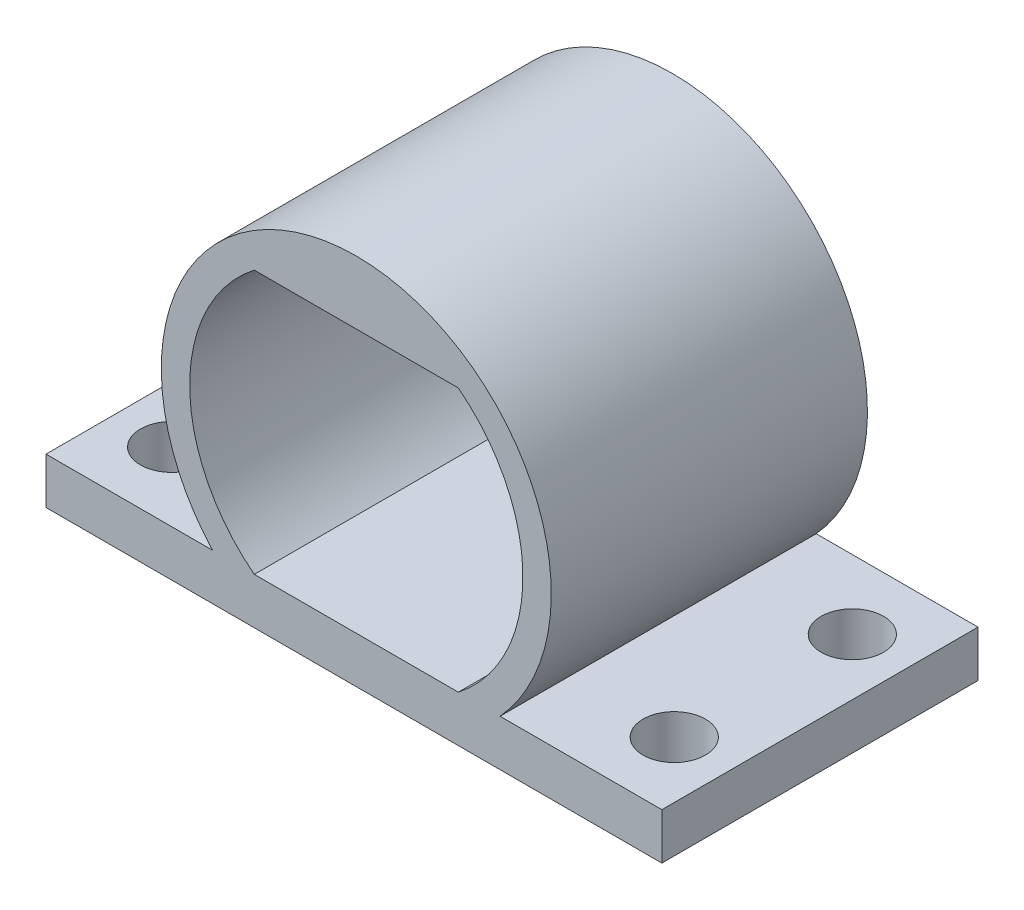
ISO-10303-21;
HEADER;
FILE_DESCRIPTION(('STEP AP214'),'2;1');
FILE_NAME('part.step','',(''),(''),'','','');
FILE_SCHEMA(('AUTOMOTIVE_DESIGN { 1 0 10303 214 1 1 1 1 }'));
ENDSEC;
DATA;
#1=APPLICATION_CONTEXT('core data for automotive mechanical design processes');
#2=APPLICATION_PROTOCOL_DEFINITION('international standard','automotive_design',2000,#1);
#3=PRODUCT_CONTEXT('',#1,'mechanical');
#4=PRODUCT('Part','Part','',(#3));
#5=PRODUCT_RELATED_PRODUCT_CATEGORY('part','',(#4));
#6=PRODUCT_DEFINITION_FORMATION('','',#4);
#7=PRODUCT_DEFINITION_CONTEXT('part definition',#1,'design');
#8=PRODUCT_DEFINITION('design','',#6,#7);
#9=PRODUCT_DEFINITION_SHAPE('','',#8);
#10=(LENGTH_UNIT() NAMED_UNIT(*) SI_UNIT(.MILLI.,.METRE.));
#11=(NAMED_UNIT(*) PLANE_ANGLE_UNIT() SI_UNIT($,.RADIAN.));
#12=(NAMED_UNIT(*) SI_UNIT($,.STERADIAN.) SOLID_ANGLE_UNIT());
#13=UNCERTAINTY_MEASURE_WITH_UNIT(LENGTH_MEASURE(1.E-05),#10,'distance_accuracy_value','');
#14=(GEOMETRIC_REPRESENTATION_CONTEXT(3) GLOBAL_UNCERTAINTY_ASSIGNED_CONTEXT((#13)) GLOBAL_UNIT_ASSIGNED_CONTEXT((#10,
#11,#12)) REPRESENTATION_CONTEXT('',''));
#15=CARTESIAN_POINT('',(0.,0.,0.));
#16=DIRECTION('',(0.,0.,1.));
#17=DIRECTION('',(1.,0.,0.));
#18=AXIS2_PLACEMENT_3D('',#15,#16,#17);
#19=CARTESIAN_POINT('',(11.5970734347748,0.,12.));
#20=DIRECTION('',(-1.,0.,0.));
#21=DIRECTION('',(0.,-1.,0.));
#22=AXIS2_PLACEMENT_3D('',#19,#20,#21);
#23=PLANE('',#22);
#24=DIRECTION('',(0.,1.,0.));
#25=VECTOR('',#24,1.);
#26=CARTESIAN_POINT('',(11.5970734347748,0.,0.));
#27=LINE('',#26,#25);
#28=CARTESIAN_POINT('',(11.5970734347748,-6.75648066721211,0.));
#29=VERTEX_POINT('',#28);
#30=CARTESIAN_POINT('',(11.5970734347748,-4.99999999999995,0.));
#31=VERTEX_POINT('',#30);
#32=EDGE_CURVE('E64',#29,#31,#27,.T.);
#33=ORIENTED_EDGE('',*,*,#32,.T.);
#34=DIRECTION('',(0.,0.,-1.));
#35=VECTOR('',#34,1.);
#36=CARTESIAN_POINT('',(11.5970734347748,-4.99999999999995,12.));
#37=LINE('',#36,#35);
#38=CARTESIAN_POINT('',(11.5970734347748,-4.99999999999995,12.));
#39=VERTEX_POINT('',#38);
#40=EDGE_CURVE('E128',#39,#31,#37,.T.);
#41=ORIENTED_EDGE('',*,*,#40,.F.);
#42=DIRECTION('',(0.,1.,0.));
#43=VECTOR('',#42,1.);
#44=CARTESIAN_POINT('',(11.5970734347748,0.,12.));
#45=LINE('',#44,#43);
#46=CARTESIAN_POINT('',(11.5970734347748,-6.75648066721211,12.));
#47=VERTEX_POINT('',#46);
#48=EDGE_CURVE('E106',#47,#39,#45,.T.);
#49=ORIENTED_EDGE('',*,*,#48,.F.);
#50=DIRECTION('',(0.,0.,1.));
#51=VECTOR('',#50,1.);
#52=CARTESIAN_POINT('',(11.5970734347748,-6.75648066721211,0.));
#53=LINE('',#52,#51);
#54=EDGE_CURVE('E187',#29,#47,#53,.T.);
#55=ORIENTED_EDGE('',*,*,#54,.F.);
#56=EDGE_LOOP('',(#33,#41,#49,#55));
#57=FACE_BOUND('',#56,.T.);
#58=ADVANCED_FACE('F35',(#57),#23,.F.);
#59=CARTESIAN_POINT('',(0.,-5.00000000000001,12.));
#60=DIRECTION('',(0.,-1.,0.));
#61=DIRECTION('',(1.,0.,0.));
#62=AXIS2_PLACEMENT_3D('',#59,#60,#61);
#63=PLANE('',#62);
#64=CARTESIAN_POINT('',(9.44716308171162,-4.99999999999998,2.6202118339138));
#65=DIRECTION('',(0.,1.,0.));
#66=DIRECTION('',(-1.,0.,0.));
#67=AXIS2_PLACEMENT_3D('',#64,#65,#66);
#68=CIRCLE('',#67,1.18469827668088);
#69=CARTESIAN_POINT('',(8.26246480503075,-4.99999999999999,2.6202118339138));
#70=VERTEX_POINT('',#69);
#71=EDGE_CURVE('E198',#70,#70,#68,.T.);
#72=ORIENTED_EDGE('',*,*,#71,.F.);
#73=EDGE_LOOP('',(#72));
#74=FACE_BOUND('',#73,.T.);
#75=CARTESIAN_POINT('',(9.44716308171162,-4.99999999999998,9.3797881660862));
#76=DIRECTION('',(0.,1.,0.));
#77=DIRECTION('',(1.,0.,0.));
#78=AXIS2_PLACEMENT_3D('',#75,#76,#77);
#79=CIRCLE('',#78,1.18469827668088);
#80=CARTESIAN_POINT('',(10.6318613583925,-4.99999999999998,9.3797881660862));
#81=VERTEX_POINT('',#80);
#82=EDGE_CURVE('E201',#81,#81,#79,.T.);
#83=ORIENTED_EDGE('',*,*,#82,.F.);
#84=EDGE_LOOP('',(#83));
#85=FACE_BOUND('',#84,.T.);
#86=DIRECTION('',(-1.,0.,0.));
#87=VECTOR('',#86,1.);
#88=CARTESIAN_POINT('',(0.,-5.00000000000001,0.));
#89=LINE('',#88,#87);
#90=CARTESIAN_POINT('',(5.45614590766997,-4.99999999999998,0.));
#91=VERTEX_POINT('',#90);
#92=EDGE_CURVE('E118',#31,#91,#89,.T.);
#93=ORIENTED_EDGE('',*,*,#92,.T.);
#94=DIRECTION('',(0.,0.,1.));
#95=VECTOR('',#94,1.);
#96=CARTESIAN_POINT('',(5.45614590766997,-4.99999999999998,0.));
#97=LINE('',#96,#95);
#98=CARTESIAN_POINT('',(5.45614590766997,-4.99999999999998,12.));
#99=VERTEX_POINT('',#98);
#100=EDGE_CURVE('E89',#91,#99,#97,.T.);
#101=ORIENTED_EDGE('',*,*,#100,.T.);
#102=DIRECTION('',(-1.,0.,0.));
#103=VECTOR('',#102,1.);
#104=CARTESIAN_POINT('',(0.,-5.00000000000001,12.));
#105=LINE('',#104,#103);
#106=EDGE_CURVE('E98',#39,#99,#105,.T.);
#107=ORIENTED_EDGE('',*,*,#106,.F.);
#108=ORIENTED_EDGE('',*,*,#40,.T.);
#109=EDGE_LOOP('',(#93,#101,#107,#108));
#110=FACE_BOUND('',#109,.T.);
#111=ADVANCED_FACE('F213',(#74,#85,#110),#63,.F.);
#112=CARTESIAN_POINT('',(0.,-5.,12.));
#113=DIRECTION('',(0.,1.,0.));
#114=DIRECTION('',(-1.,0.,0.));
#115=AXIS2_PLACEMENT_3D('',#112,#113,#114);
#116=PLANE('',#115);
#117=DIRECTION('',(0.,0.,1.));
#118=VECTOR('',#117,1.);
#119=CARTESIAN_POINT('',(-5.45614590766993,-5.00000000000002,0.));
#120=LINE('',#119,#118);
#121=CARTESIAN_POINT('',(-5.45614590766993,-5.00000000000002,0.));
#122=VERTEX_POINT('',#121);
#123=CARTESIAN_POINT('',(-5.45614590766993,-5.00000000000002,12.));
#124=VERTEX_POINT('',#123);
#125=EDGE_CURVE('E82',#122,#124,#120,.T.);
#126=ORIENTED_EDGE('',*,*,#125,.F.);
#127=DIRECTION('',(1.,0.,0.));
#128=VECTOR('',#127,1.);
#129=CARTESIAN_POINT('',(0.,-5.,0.));
#130=LINE('',#129,#128);
#131=CARTESIAN_POINT('',(-11.7770736373848,-5.00000000000003,0.));
#132=VERTEX_POINT('',#131);
#133=EDGE_CURVE('E121',#132,#122,#130,.T.);
#134=ORIENTED_EDGE('',*,*,#133,.F.);
#135=DIRECTION('',(0.,0.,-1.));
#136=VECTOR('',#135,1.);
#137=CARTESIAN_POINT('',(-11.7770736373848,-5.00000000000003,12.));
#138=LINE('',#137,#136);
#139=CARTESIAN_POINT('',(-11.7770736373848,-5.00000000000003,12.));
#140=VERTEX_POINT('',#139);
#141=EDGE_CURVE('E52',#140,#132,#138,.T.);
#142=ORIENTED_EDGE('',*,*,#141,.F.);
#143=DIRECTION('',(1.,0.,0.));
#144=VECTOR('',#143,1.);
#145=CARTESIAN_POINT('',(0.,-5.,12.));
#146=LINE('',#145,#144);
#147=EDGE_CURVE('E95',#140,#124,#146,.T.);
#148=ORIENTED_EDGE('',*,*,#147,.T.);
#149=EDGE_LOOP('',(#126,#134,#142,#148));
#150=FACE_BOUND('',#149,.T.);
#151=CARTESIAN_POINT('',(-9.62716328432161,-5.00000000000003,2.6202118339138));
#152=DIRECTION('',(0.,1.,0.));
#153=DIRECTION('',(1.,0.,0.));
#154=AXIS2_PLACEMENT_3D('',#151,#152,#153);
#155=CIRCLE('',#154,1.18469827668088);
#156=CARTESIAN_POINT('',(-8.44246500764073,-5.00000000000002,2.6202118339138));
#157=VERTEX_POINT('',#156);
#158=EDGE_CURVE('E88',#157,#157,#155,.T.);
#159=ORIENTED_EDGE('',*,*,#158,.F.);
#160=EDGE_LOOP('',(#159));
#161=FACE_BOUND('',#160,.T.);
#162=CARTESIAN_POINT('',(-9.62716328432161,-5.00000000000003,9.3797881660862));
#163=DIRECTION('',(0.,1.,0.));
#164=DIRECTION('',(-1.,0.,0.));
#165=AXIS2_PLACEMENT_3D('',#162,#163,#164);
#166=CIRCLE('',#165,1.18469827668088);
#167=CARTESIAN_POINT('',(-10.8118615610025,-5.00000000000003,9.3797881660862));
#168=VERTEX_POINT('',#167);
#169=EDGE_CURVE('E114',#168,#168,#166,.T.);
#170=ORIENTED_EDGE('',*,*,#169,.F.);
#171=EDGE_LOOP('',(#170));
#172=FACE_BOUND('',#171,.T.);
#173=ADVANCED_FACE('F101',(#150,#161,#172),#116,.T.);
#174=CARTESIAN_POINT('',(0.,-5.,12.));
#175=DIRECTION('',(0.,1.,0.));
#176=DIRECTION('',(-1.,0.,0.));
#177=AXIS2_PLACEMENT_3D('',#174,#175,#176);
#178=PLANE('',#177);
#179=DIRECTION('',(1.,0.,0.));
#180=VECTOR('',#179,1.);
#181=CARTESIAN_POINT('',(0.,-5.,0.));
#182=LINE('',#181,#180);
#183=CARTESIAN_POINT('',(-3.87177420326201,-5.00000000000001,0.));
#184=VERTEX_POINT('',#183);
#185=CARTESIAN_POINT('',(3.87177420326201,-5.00000000000001,0.));
#186=VERTEX_POINT('',#185);
#187=EDGE_CURVE('E110',#184,#186,#182,.T.);
#188=ORIENTED_EDGE('',*,*,#187,.F.);
#189=DIRECTION('',(0.,0.,1.));
#190=VECTOR('',#189,1.);
#191=CARTESIAN_POINT('',(-3.87177420326201,-5.00000000000001,-7.));
#192=LINE('',#191,#190);
#193=CARTESIAN_POINT('',(-3.87177420326201,-5.00000000000001,12.));
#194=VERTEX_POINT('',#193);
#195=EDGE_CURVE('E165',#184,#194,#192,.T.);
#196=ORIENTED_EDGE('',*,*,#195,.T.);
#197=DIRECTION('',(1.,0.,0.));
#198=VECTOR('',#197,1.);
#199=CARTESIAN_POINT('',(0.,-5.,12.));
#200=LINE('',#199,#198);
#201=CARTESIAN_POINT('',(3.87177420326201,-5.00000000000001,12.));
#202=VERTEX_POINT('',#201);
#203=EDGE_CURVE('E126',#194,#202,#200,.T.);
#204=ORIENTED_EDGE('',*,*,#203,.T.);
#205=DIRECTION('',(0.,0.,1.));
#206=VECTOR('',#205,1.);
#207=CARTESIAN_POINT('',(3.87177420326201,-5.00000000000001,-7.));
#208=LINE('',#207,#206);
#209=EDGE_CURVE('E177',#186,#202,#208,.T.);
#210=ORIENTED_EDGE('',*,*,#209,.F.);
#211=EDGE_LOOP('',(#188,#196,#204,#210));
#212=FACE_BOUND('',#211,.T.);
#213=ADVANCED_FACE('F37',(#212),#178,.T.);
#214=CARTESIAN_POINT('',(0.,5.,12.));
#215=DIRECTION('',(0.,1.,0.));
#216=DIRECTION('',(-1.,0.,0.));
#217=AXIS2_PLACEMENT_3D('',#214,#215,#216);
#218=PLANE('',#217);
#219=DIRECTION('',(1.,0.,0.));
#220=VECTOR('',#219,1.);
#221=CARTESIAN_POINT('',(0.,5.,0.));
#222=LINE('',#221,#220);
#223=CARTESIAN_POINT('',(-3.87177420326204,4.99999999999999,0.));
#224=VERTEX_POINT('',#223);
#225=CARTESIAN_POINT('',(3.87177420326204,4.99999999999999,0.));
#226=VERTEX_POINT('',#225);
#227=EDGE_CURVE('E113',#224,#226,#222,.T.);
#228=ORIENTED_EDGE('',*,*,#227,.T.);
#229=DIRECTION('',(0.,0.,1.));
#230=VECTOR('',#229,1.);
#231=CARTESIAN_POINT('',(3.87177420326204,4.99999999999999,-7.));
#232=LINE('',#231,#230);
#233=CARTESIAN_POINT('',(3.87177420326204,4.99999999999999,12.));
#234=VERTEX_POINT('',#233);
#235=EDGE_CURVE('E142',#226,#234,#232,.T.);
#236=ORIENTED_EDGE('',*,*,#235,.T.);
#237=DIRECTION('',(1.,0.,0.));
#238=VECTOR('',#237,1.);
#239=CARTESIAN_POINT('',(0.,5.,12.));
#240=LINE('',#239,#238);
#241=CARTESIAN_POINT('',(-3.87177420326204,4.99999999999999,12.));
#242=VERTEX_POINT('',#241);
#243=EDGE_CURVE('E174',#242,#234,#240,.T.);
#244=ORIENTED_EDGE('',*,*,#243,.F.);
#245=DIRECTION('',(0.,0.,1.));
#246=VECTOR('',#245,1.);
#247=CARTESIAN_POINT('',(-3.87177420326204,4.99999999999999,-7.));
#248=LINE('',#247,#246);
#249=EDGE_CURVE('E162',#224,#242,#248,.T.);
#250=ORIENTED_EDGE('',*,*,#249,.F.);
#251=EDGE_LOOP('',(#228,#236,#244,#250));
#252=FACE_BOUND('',#251,.T.);
#253=ADVANCED_FACE('F170',(#252),#218,.F.);
#254=CARTESIAN_POINT('',(-11.7770736373848,0.,12.));
#255=DIRECTION('',(-1.,0.,0.));
#256=DIRECTION('',(0.,0.,1.));
#257=AXIS2_PLACEMENT_3D('',#254,#255,#256);
#258=PLANE('',#257);
#259=DIRECTION('',(0.,1.,0.));
#260=VECTOR('',#259,1.);
#261=CARTESIAN_POINT('',(-11.7770736373848,0.,0.));
#262=LINE('',#261,#260);
#263=CARTESIAN_POINT('',(-11.7770736373848,-6.75648066721211,0.));
#264=VERTEX_POINT('',#263);
#265=EDGE_CURVE('E123',#264,#132,#262,.T.);
#266=ORIENTED_EDGE('',*,*,#265,.F.);
#267=DIRECTION('',(0.,0.,1.));
#268=VECTOR('',#267,1.);
#269=CARTESIAN_POINT('',(-11.7770736373848,-6.75648066721211,0.));
#270=LINE('',#269,#268);
#271=CARTESIAN_POINT('',(-11.7770736373848,-6.75648066721211,12.));
#272=VERTEX_POINT('',#271);
#273=EDGE_CURVE('E99',#264,#272,#270,.T.);
#274=ORIENTED_EDGE('',*,*,#273,.T.);
#275=DIRECTION('',(0.,1.,0.));
#276=VECTOR('',#275,1.);
#277=CARTESIAN_POINT('',(-11.7770736373848,0.,12.));
#278=LINE('',#277,#276);
#279=EDGE_CURVE('E103',#272,#140,#278,.T.);
#280=ORIENTED_EDGE('',*,*,#279,.T.);
#281=ORIENTED_EDGE('',*,*,#141,.T.);
#282=EDGE_LOOP('',(#266,#274,#280,#281));
#283=FACE_BOUND('',#282,.T.);
#284=ADVANCED_FACE('F218',(#283),#258,.T.);
#285=CARTESIAN_POINT('',(0.,0.,12.));
#286=DIRECTION('',(0.,0.,1.));
#287=DIRECTION('',(1.,0.,0.));
#288=AXIS2_PLACEMENT_3D('',#285,#286,#287);
#289=PLANE('',#288);
#290=CARTESIAN_POINT('',(0.,0.,12.));
#291=DIRECTION('',(0.,0.,1.));
#292=DIRECTION('',(1.,0.,0.));
#293=AXIS2_PLACEMENT_3D('',#290,#291,#292);
#294=CIRCLE('',#293,6.32381494677424);
#295=EDGE_CURVE('E175',#202,#234,#294,.T.);
#296=ORIENTED_EDGE('',*,*,#295,.F.);
#297=ORIENTED_EDGE('',*,*,#203,.F.);
#298=CARTESIAN_POINT('',(0.,0.,12.));
#299=DIRECTION('',(0.,0.,1.));
#300=DIRECTION('',(1.,0.,0.));
#301=AXIS2_PLACEMENT_3D('',#298,#299,#300);
#302=CIRCLE('',#301,6.32381494677424);
#303=EDGE_CURVE('E180',#242,#194,#302,.T.);
#304=ORIENTED_EDGE('',*,*,#303,.F.);
#305=ORIENTED_EDGE('',*,*,#243,.T.);
#306=EDGE_LOOP('',(#296,#297,#304,#305));
#307=FACE_BOUND('',#306,.T.);
#308=ORIENTED_EDGE('',*,*,#279,.F.);
#309=DIRECTION('',(1.,0.,0.));
#310=VECTOR('',#309,1.);
#311=CARTESIAN_POINT('',(0.,-6.75648066721211,12.));
#312=LINE('',#311,#310);
#313=EDGE_CURVE('E133',#272,#47,#312,.T.);
#314=ORIENTED_EDGE('',*,*,#313,.T.);
#315=ORIENTED_EDGE('',*,*,#48,.T.);
#316=ORIENTED_EDGE('',*,*,#106,.T.);
#317=CARTESIAN_POINT('',(0.,0.,12.));
#318=DIRECTION('',(0.,0.,1.));
#319=DIRECTION('',(1.,0.,0.));
#320=AXIS2_PLACEMENT_3D('',#317,#318,#319);
#321=CIRCLE('',#320,7.40064376698295);
#322=EDGE_CURVE('E85',#99,#124,#321,.T.);
#323=ORIENTED_EDGE('',*,*,#322,.T.);
#324=ORIENTED_EDGE('',*,*,#147,.F.);
#325=EDGE_LOOP('',(#308,#314,#315,#316,#323,#324));
#326=FACE_BOUND('',#325,.T.);
#327=ADVANCED_FACE('F94',(#307,#326),#289,.T.);
#328=CARTESIAN_POINT('',(0.,0.,0.));
#329=DIRECTION('',(0.,0.,1.));
#330=DIRECTION('',(1.,0.,0.));
#331=AXIS2_PLACEMENT_3D('',#328,#329,#330);
#332=PLANE('',#331);
#333=ORIENTED_EDGE('',*,*,#187,.T.);
#334=CARTESIAN_POINT('',(0.,0.,0.));
#335=DIRECTION('',(0.,0.,1.));
#336=DIRECTION('',(1.,0.,0.));
#337=AXIS2_PLACEMENT_3D('',#334,#335,#336);
#338=CIRCLE('',#337,6.32381494677424);
#339=EDGE_CURVE('E11',#186,#226,#338,.T.);
#340=ORIENTED_EDGE('',*,*,#339,.T.);
#341=ORIENTED_EDGE('',*,*,#227,.F.);
#342=CARTESIAN_POINT('',(0.,0.,0.));
#343=DIRECTION('',(0.,0.,1.));
#344=DIRECTION('',(1.,0.,0.));
#345=AXIS2_PLACEMENT_3D('',#342,#343,#344);
#346=CIRCLE('',#345,6.32381494677424);
#347=EDGE_CURVE('E44',#224,#184,#346,.T.);
#348=ORIENTED_EDGE('',*,*,#347,.T.);
#349=EDGE_LOOP('',(#333,#340,#341,#348));
#350=FACE_BOUND('',#349,.T.);
#351=ORIENTED_EDGE('',*,*,#32,.F.);
#352=DIRECTION('',(1.,0.,0.));
#353=VECTOR('',#352,1.);
#354=CARTESIAN_POINT('',(0.,-6.75648066721211,0.));
#355=LINE('',#354,#353);
#356=EDGE_CURVE('E184',#264,#29,#355,.T.);
#357=ORIENTED_EDGE('',*,*,#356,.F.);
#358=ORIENTED_EDGE('',*,*,#265,.T.);
#359=ORIENTED_EDGE('',*,*,#133,.T.);
#360=CARTESIAN_POINT('',(0.,0.,0.));
#361=DIRECTION('',(0.,0.,1.));
#362=DIRECTION('',(1.,0.,0.));
#363=AXIS2_PLACEMENT_3D('',#360,#361,#362);
#364=CIRCLE('',#363,7.40064376698295);
#365=EDGE_CURVE('E73',#91,#122,#364,.T.);
#366=ORIENTED_EDGE('',*,*,#365,.F.);
#367=ORIENTED_EDGE('',*,*,#92,.F.);
#368=EDGE_LOOP('',(#351,#357,#358,#359,#366,#367));
#369=FACE_BOUND('',#368,.T.);
#370=ADVANCED_FACE('F148',(#350,#369),#332,.F.);
#371=CARTESIAN_POINT('',(-9.6271632843216,-10.,9.3797881660862));
#372=DIRECTION('',(0.,1.,0.));
#373=DIRECTION('',(-1.,0.,0.));
#374=AXIS2_PLACEMENT_3D('',#371,#372,#373);
#375=CYLINDRICAL_SURFACE('',#374,1.18469827668088);
#376=ORIENTED_EDGE('',*,*,#169,.T.);
#377=EDGE_LOOP('',(#376));
#378=FACE_BOUND('',#377,.T.);
#379=CARTESIAN_POINT('',(-9.62716328432161,-6.75648066721211,9.3797881660862));
#380=DIRECTION('',(0.,-1.,0.));
#381=DIRECTION('',(0.,0.,-1.));
#382=AXIS2_PLACEMENT_3D('',#379,#380,#381);
#383=CIRCLE('',#382,1.18469827668088);
#384=CARTESIAN_POINT('',(-9.62716328432161,-6.75648066721211,8.19508988940532));
#385=VERTEX_POINT('',#384);
#386=EDGE_CURVE('E134',#385,#385,#383,.T.);
#387=ORIENTED_EDGE('',*,*,#386,.T.);
#388=EDGE_LOOP('',(#387));
#389=FACE_BOUND('',#388,.T.);
#390=ADVANCED_FACE('F273',(#378,#389),#375,.F.);
#391=CARTESIAN_POINT('',(9.44716308171164,-9.99999999999998,9.3797881660862));
#392=DIRECTION('',(0.,1.,0.));
#393=DIRECTION('',(-1.,0.,0.));
#394=AXIS2_PLACEMENT_3D('',#391,#392,#393);
#395=CYLINDRICAL_SURFACE('',#394,1.18469827668088);
#396=ORIENTED_EDGE('',*,*,#82,.T.);
#397=EDGE_LOOP('',(#396));
#398=FACE_BOUND('',#397,.T.);
#399=CARTESIAN_POINT('',(9.44716308171163,-6.75648066721211,9.3797881660862));
#400=DIRECTION('',(0.,-1.,0.));
#401=DIRECTION('',(0.,0.,-1.));
#402=AXIS2_PLACEMENT_3D('',#399,#400,#401);
#403=CIRCLE('',#402,1.18469827668088);
#404=CARTESIAN_POINT('',(9.44716308171163,-6.75648066721211,8.19508988940532));
#405=VERTEX_POINT('',#404);
#406=EDGE_CURVE('E140',#405,#405,#403,.T.);
#407=ORIENTED_EDGE('',*,*,#406,.T.);
#408=EDGE_LOOP('',(#407));
#409=FACE_BOUND('',#408,.T.);
#410=ADVANCED_FACE('F278',(#398,#409),#395,.F.);
#411=CARTESIAN_POINT('',(9.44716308171164,-9.99999999999998,2.6202118339138));
#412=DIRECTION('',(0.,1.,0.));
#413=DIRECTION('',(-1.,0.,0.));
#414=AXIS2_PLACEMENT_3D('',#411,#412,#413);
#415=CYLINDRICAL_SURFACE('',#414,1.18469827668088);
#416=ORIENTED_EDGE('',*,*,#71,.T.);
#417=EDGE_LOOP('',(#416));
#418=FACE_BOUND('',#417,.T.);
#419=CARTESIAN_POINT('',(9.44716308171163,-6.75648066721211,2.6202118339138));
#420=DIRECTION('',(0.,-1.,0.));
#421=DIRECTION('',(0.,0.,-1.));
#422=AXIS2_PLACEMENT_3D('',#419,#420,#421);
#423=CIRCLE('',#422,1.18469827668088);
#424=CARTESIAN_POINT('',(9.44716308171163,-6.75648066721211,1.43551355723292));
#425=VERTEX_POINT('',#424);
#426=EDGE_CURVE('E137',#425,#425,#423,.T.);
#427=ORIENTED_EDGE('',*,*,#426,.T.);
#428=EDGE_LOOP('',(#427));
#429=FACE_BOUND('',#428,.T.);
#430=ADVANCED_FACE('F282',(#418,#429),#415,.F.);
#431=CARTESIAN_POINT('',(-9.6271632843216,-10.,2.6202118339138));
#432=DIRECTION('',(0.,1.,0.));
#433=DIRECTION('',(-1.,0.,0.));
#434=AXIS2_PLACEMENT_3D('',#431,#432,#433);
#435=CYLINDRICAL_SURFACE('',#434,1.18469827668088);
#436=ORIENTED_EDGE('',*,*,#158,.T.);
#437=EDGE_LOOP('',(#436));
#438=FACE_BOUND('',#437,.T.);
#439=CARTESIAN_POINT('',(-9.62716328432161,-6.75648066721211,2.6202118339138));
#440=DIRECTION('',(0.,-1.,0.));
#441=DIRECTION('',(0.,0.,-1.));
#442=AXIS2_PLACEMENT_3D('',#439,#440,#441);
#443=CIRCLE('',#442,1.18469827668088);
#444=CARTESIAN_POINT('',(-9.62716328432161,-6.75648066721211,1.43551355723292));
#445=VERTEX_POINT('',#444);
#446=EDGE_CURVE('E130',#445,#445,#443,.T.);
#447=ORIENTED_EDGE('',*,*,#446,.T.);
#448=EDGE_LOOP('',(#447));
#449=FACE_BOUND('',#448,.T.);
#450=ADVANCED_FACE('F286',(#438,#449),#435,.F.);
#451=CARTESIAN_POINT('',(0.,0.,0.));
#452=DIRECTION('',(0.,0.,1.));
#453=DIRECTION('',(1.,0.,0.));
#454=AXIS2_PLACEMENT_3D('',#451,#452,#453);
#455=CYLINDRICAL_SURFACE('',#454,7.40064376698295);
#456=ORIENTED_EDGE('',*,*,#322,.F.);
#457=ORIENTED_EDGE('',*,*,#100,.F.);
#458=ORIENTED_EDGE('',*,*,#365,.T.);
#459=ORIENTED_EDGE('',*,*,#125,.T.);
#460=EDGE_LOOP('',(#456,#457,#458,#459));
#461=FACE_BOUND('',#460,.T.);
#462=ADVANCED_FACE('F84',(#461),#455,.T.);
#463=CARTESIAN_POINT('',(0.,-6.75648066721211,0.));
#464=DIRECTION('',(0.,-1.,0.));
#465=DIRECTION('',(0.,0.,-1.));
#466=AXIS2_PLACEMENT_3D('',#463,#464,#465);
#467=PLANE('',#466);
#468=ORIENTED_EDGE('',*,*,#406,.F.);
#469=EDGE_LOOP('',(#468));
#470=FACE_BOUND('',#469,.T.);
#471=ORIENTED_EDGE('',*,*,#426,.F.);
#472=EDGE_LOOP('',(#471));
#473=FACE_BOUND('',#472,.T.);
#474=ORIENTED_EDGE('',*,*,#386,.F.);
#475=EDGE_LOOP('',(#474));
#476=FACE_BOUND('',#475,.T.);
#477=ORIENTED_EDGE('',*,*,#446,.F.);
#478=EDGE_LOOP('',(#477));
#479=FACE_BOUND('',#478,.T.);
#480=ORIENTED_EDGE('',*,*,#313,.F.);
#481=ORIENTED_EDGE('',*,*,#273,.F.);
#482=ORIENTED_EDGE('',*,*,#356,.T.);
#483=ORIENTED_EDGE('',*,*,#54,.T.);
#484=EDGE_LOOP('',(#480,#481,#482,#483));
#485=FACE_BOUND('',#484,.T.);
#486=ADVANCED_FACE('F223',(#470,#473,#476,#479,#485),#467,.T.);
#487=CARTESIAN_POINT('',(0.,0.,-7.));
#488=DIRECTION('',(0.,0.,1.));
#489=DIRECTION('',(1.,0.,0.));
#490=AXIS2_PLACEMENT_3D('',#487,#488,#489);
#491=CYLINDRICAL_SURFACE('',#490,6.32381494677424);
#492=ORIENTED_EDGE('',*,*,#249,.T.);
#493=ORIENTED_EDGE('',*,*,#303,.T.);
#494=ORIENTED_EDGE('',*,*,#195,.F.);
#495=ORIENTED_EDGE('',*,*,#347,.F.);
#496=EDGE_LOOP('',(#492,#493,#494,#495));
#497=FACE_BOUND('',#496,.T.);
#498=ADVANCED_FACE('F159',(#497),#491,.F.);
#499=CARTESIAN_POINT('',(0.,0.,-7.));
#500=DIRECTION('',(0.,0.,1.));
#501=DIRECTION('',(1.,0.,0.));
#502=AXIS2_PLACEMENT_3D('',#499,#500,#501);
#503=CYLINDRICAL_SURFACE('',#502,6.32381494677424);
#504=ORIENTED_EDGE('',*,*,#209,.T.);
#505=ORIENTED_EDGE('',*,*,#295,.T.);
#506=ORIENTED_EDGE('',*,*,#235,.F.);
#507=ORIENTED_EDGE('',*,*,#339,.F.);
#508=EDGE_LOOP('',(#504,#505,#506,#507));
#509=FACE_BOUND('',#508,.T.);
#510=ADVANCED_FACE('F244',(#509),#503,.F.);
#511=CLOSED_SHELL('',(#58,#111,#173,#213,#253,#284,#327,#370,#390,#410,#430,#450,#462,#486,#498,#510));
#512=MANIFOLD_SOLID_BREP('B2',#511);
#513=ADVANCED_BREP_SHAPE_REPRESENTATION('',(#18,#512),#14);
#514=SHAPE_DEFINITION_REPRESENTATION(#9,#513);
ENDSEC;
END-ISO-10303-21;
